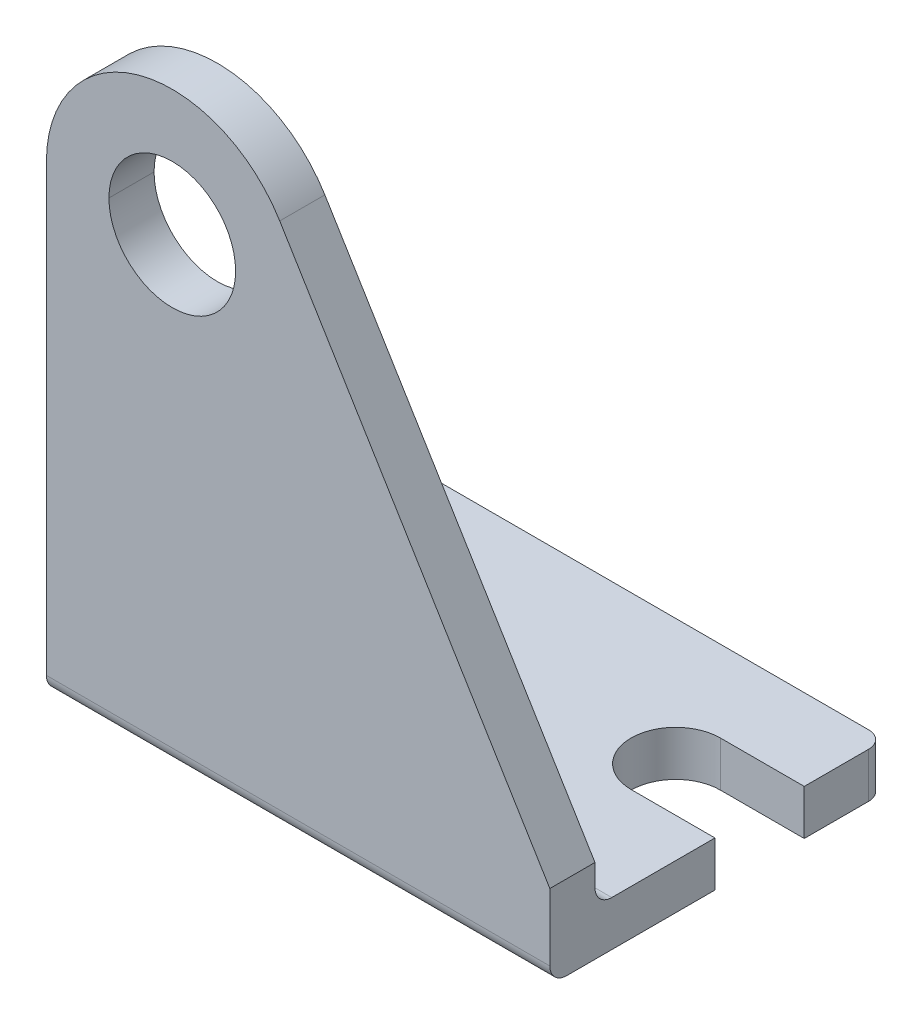
ISO-10303-21;
HEADER;
FILE_DESCRIPTION(('STEP AP214'),'2;1');
FILE_NAME('part.step','',(''),(''),'','','');
FILE_SCHEMA(('AUTOMOTIVE_DESIGN { 1 0 10303 214 1 1 1 1 }'));
ENDSEC;
DATA;
#1=APPLICATION_CONTEXT('core data for automotive mechanical design processes');
#2=APPLICATION_PROTOCOL_DEFINITION('international standard','automotive_design',2000,#1);
#3=PRODUCT_CONTEXT('',#1,'mechanical');
#4=PRODUCT('Part','Part','',(#3));
#5=PRODUCT_RELATED_PRODUCT_CATEGORY('part','',(#4));
#6=PRODUCT_DEFINITION_FORMATION('','',#4);
#7=PRODUCT_DEFINITION_CONTEXT('part definition',#1,'design');
#8=PRODUCT_DEFINITION('design','',#6,#7);
#9=PRODUCT_DEFINITION_SHAPE('','',#8);
#10=(LENGTH_UNIT() NAMED_UNIT(*) SI_UNIT(.MILLI.,.METRE.));
#11=(NAMED_UNIT(*) PLANE_ANGLE_UNIT() SI_UNIT($,.RADIAN.));
#12=(NAMED_UNIT(*) SI_UNIT($,.STERADIAN.) SOLID_ANGLE_UNIT());
#13=UNCERTAINTY_MEASURE_WITH_UNIT(LENGTH_MEASURE(1.E-05),#10,'distance_accuracy_value','');
#14=(GEOMETRIC_REPRESENTATION_CONTEXT(3) GLOBAL_UNCERTAINTY_ASSIGNED_CONTEXT((#13)) GLOBAL_UNIT_ASSIGNED_CONTEXT((#10,
#11,#12)) REPRESENTATION_CONTEXT('',''));
#15=CARTESIAN_POINT('',(0.,0.,0.));
#16=DIRECTION('',(0.,0.,1.));
#17=DIRECTION('',(1.,0.,0.));
#18=AXIS2_PLACEMENT_3D('',#15,#16,#17);
#19=CARTESIAN_POINT('',(6.35,3.4163,-19.2532));
#20=DIRECTION('',(0.,0.,1.));
#21=DIRECTION('',(1.,0.,0.));
#22=AXIS2_PLACEMENT_3D('',#19,#20,#21);
#23=PLANE('',#22);
#24=DIRECTION('',(-1.,0.,0.));
#25=VECTOR('',#24,1.);
#26=CARTESIAN_POINT('',(6.35,0.,-19.2532));
#27=LINE('',#26,#25);
#28=CARTESIAN_POINT('',(6.35,0.,-19.2532));
#29=VERTEX_POINT('',#28);
#30=CARTESIAN_POINT('',(0.,0.,-19.2532));
#31=VERTEX_POINT('',#30);
#32=EDGE_CURVE('E11',#29,#31,#27,.T.);
#33=ORIENTED_EDGE('',*,*,#32,.F.);
#34=DIRECTION('',(0.,-1.,0.));
#35=VECTOR('',#34,1.);
#36=CARTESIAN_POINT('',(6.35,3.4163,-19.2532));
#37=LINE('',#36,#35);
#38=CARTESIAN_POINT('',(6.35,3.4163,-19.2532));
#39=VERTEX_POINT('',#38);
#40=EDGE_CURVE('E25',#39,#29,#37,.T.);
#41=ORIENTED_EDGE('',*,*,#40,.F.);
#42=DIRECTION('',(-1.,0.,0.));
#43=VECTOR('',#42,1.);
#44=CARTESIAN_POINT('',(6.35,3.4163,-19.2532));
#45=LINE('',#44,#43);
#46=CARTESIAN_POINT('',(0.,3.4163,-19.2532));
#47=VERTEX_POINT('',#46);
#48=EDGE_CURVE('E432',#39,#47,#45,.T.);
#49=ORIENTED_EDGE('',*,*,#48,.T.);
#50=DIRECTION('',(0.,-1.,0.));
#51=VECTOR('',#50,1.);
#52=CARTESIAN_POINT('',(0.,3.4163,-19.2532));
#53=LINE('',#52,#51);
#54=EDGE_CURVE('E428',#47,#31,#53,.T.);
#55=ORIENTED_EDGE('',*,*,#54,.T.);
#56=EDGE_LOOP('',(#33,#41,#49,#55));
#57=FACE_BOUND('',#56,.T.);
#58=ADVANCED_FACE('F17',(#57),#23,.T.);
#59=CARTESIAN_POINT('',(0.,1.26999999999997,-1.26999999999999));
#60=DIRECTION('',(1.,0.,0.));
#61=DIRECTION('',(0.,0.,-1.));
#62=AXIS2_PLACEMENT_3D('',#59,#60,#61);
#63=PLANE('',#62);
#64=DIRECTION('',(0.,-1.,0.));
#65=VECTOR('',#64,1.);
#66=CARTESIAN_POINT('',(0.,3.4163,-24.13));
#67=LINE('',#66,#65);
#68=CARTESIAN_POINT('',(0.,3.4163,-24.13));
#69=VERTEX_POINT('',#68);
#70=CARTESIAN_POINT('',(0.,0.,-24.13));
#71=VERTEX_POINT('',#70);
#72=EDGE_CURVE('E424',#69,#71,#67,.T.);
#73=ORIENTED_EDGE('',*,*,#72,.T.);
#74=DIRECTION('',(0.,0.,-1.));
#75=VECTOR('',#74,1.);
#76=CARTESIAN_POINT('',(0.,0.,-1.27));
#77=LINE('',#76,#75);
#78=EDGE_CURVE('E419',#31,#71,#77,.T.);
#79=ORIENTED_EDGE('',*,*,#78,.F.);
#80=ORIENTED_EDGE('',*,*,#54,.F.);
#81=DIRECTION('',(0.,0.,1.));
#82=VECTOR('',#81,1.);
#83=CARTESIAN_POINT('',(0.,3.4163,-25.4));
#84=LINE('',#83,#82);
#85=EDGE_CURVE('E414',#69,#47,#84,.T.);
#86=ORIENTED_EDGE('',*,*,#85,.F.);
#87=EDGE_LOOP('',(#73,#79,#80,#86));
#88=FACE_BOUND('',#87,.T.);
#89=ADVANCED_FACE('F450',(#88),#63,.F.);
#90=CARTESIAN_POINT('',(38.1,3.4163,-25.4));
#91=DIRECTION('',(0.,-1.,0.));
#92=DIRECTION('',(0.,0.,-1.));
#93=AXIS2_PLACEMENT_3D('',#90,#91,#92);
#94=PLANE('',#93);
#95=DIRECTION('',(-1.,0.,0.));
#96=VECTOR('',#95,1.);
#97=CARTESIAN_POINT('',(38.1,3.4163,-25.4));
#98=LINE('',#97,#96);
#99=CARTESIAN_POINT('',(36.83,3.4163,-25.4));
#100=VERTEX_POINT('',#99);
#101=CARTESIAN_POINT('',(1.26999999999986,3.4163,-25.4));
#102=VERTEX_POINT('',#101);
#103=EDGE_CURVE('E410',#100,#102,#98,.T.);
#104=ORIENTED_EDGE('',*,*,#103,.T.);
#105=CARTESIAN_POINT('',(1.26999999999984,3.4163,-24.1300000000001));
#106=DIRECTION('',(0.,1.,0.));
#107=DIRECTION('',(1.,0.,0.));
#108=AXIS2_PLACEMENT_3D('',#105,#106,#107);
#109=CIRCLE('',#108,1.27);
#110=EDGE_CURVE('E405',#102,#69,#109,.T.);
#111=ORIENTED_EDGE('',*,*,#110,.T.);
#112=ORIENTED_EDGE('',*,*,#85,.T.);
#113=ORIENTED_EDGE('',*,*,#48,.F.);
#114=CARTESIAN_POINT('',(6.35,3.4163,-15.875));
#115=DIRECTION('',(0.,1.,0.));
#116=DIRECTION('',(1.,0.,0.));
#117=AXIS2_PLACEMENT_3D('',#114,#115,#116);
#118=CIRCLE('',#117,3.3782);
#119=CARTESIAN_POINT('',(6.35,3.4163,-12.4968));
#120=VERTEX_POINT('',#119);
#121=EDGE_CURVE('E400',#120,#39,#118,.T.);
#122=ORIENTED_EDGE('',*,*,#121,.F.);
#123=DIRECTION('',(1.,0.,0.));
#124=VECTOR('',#123,1.);
#125=CARTESIAN_POINT('',(0.,3.4163,-12.4968));
#126=LINE('',#125,#124);
#127=CARTESIAN_POINT('',(0.,3.4163,-12.4968));
#128=VERTEX_POINT('',#127);
#129=EDGE_CURVE('E395',#128,#120,#126,.T.);
#130=ORIENTED_EDGE('',*,*,#129,.F.);
#131=DIRECTION('',(0.,0.,1.));
#132=VECTOR('',#131,1.);
#133=CARTESIAN_POINT('',(0.,3.4163,-25.4));
#134=LINE('',#133,#132);
#135=CARTESIAN_POINT('',(0.,3.4163,-4.6863));
#136=VERTEX_POINT('',#135);
#137=EDGE_CURVE('E391',#128,#136,#134,.T.);
#138=ORIENTED_EDGE('',*,*,#137,.T.);
#139=DIRECTION('',(-1.,0.,0.));
#140=VECTOR('',#139,1.);
#141=CARTESIAN_POINT('',(38.1,3.4163,-4.6863));
#142=LINE('',#141,#140);
#143=CARTESIAN_POINT('',(38.1,3.4163,-4.6863));
#144=VERTEX_POINT('',#143);
#145=EDGE_CURVE('E386',#144,#136,#142,.T.);
#146=ORIENTED_EDGE('',*,*,#145,.F.);
#147=DIRECTION('',(0.,0.,1.));
#148=VECTOR('',#147,1.);
#149=CARTESIAN_POINT('',(38.1,3.4163,-25.4));
#150=LINE('',#149,#148);
#151=CARTESIAN_POINT('',(38.1,3.4163,-12.4968));
#152=VERTEX_POINT('',#151);
#153=EDGE_CURVE('E381',#152,#144,#150,.T.);
#154=ORIENTED_EDGE('',*,*,#153,.F.);
#155=DIRECTION('',(1.,0.,0.));
#156=VECTOR('',#155,1.);
#157=CARTESIAN_POINT('',(31.75,3.4163,-12.4968));
#158=LINE('',#157,#156);
#159=CARTESIAN_POINT('',(31.75,3.4163,-12.4968));
#160=VERTEX_POINT('',#159);
#161=EDGE_CURVE('E376',#160,#152,#158,.T.);
#162=ORIENTED_EDGE('',*,*,#161,.F.);
#163=CARTESIAN_POINT('',(31.75,3.4163,-15.875));
#164=DIRECTION('',(0.,1.,0.));
#165=DIRECTION('',(1.,0.,0.));
#166=AXIS2_PLACEMENT_3D('',#163,#164,#165);
#167=CIRCLE('',#166,3.3782);
#168=CARTESIAN_POINT('',(31.75,3.4163,-19.2532));
#169=VERTEX_POINT('',#168);
#170=EDGE_CURVE('E371',#169,#160,#167,.T.);
#171=ORIENTED_EDGE('',*,*,#170,.F.);
#172=DIRECTION('',(-1.,0.,0.));
#173=VECTOR('',#172,1.);
#174=CARTESIAN_POINT('',(38.1,3.4163,-19.2532));
#175=LINE('',#174,#173);
#176=CARTESIAN_POINT('',(38.1,3.4163,-19.2532));
#177=VERTEX_POINT('',#176);
#178=EDGE_CURVE('E366',#177,#169,#175,.T.);
#179=ORIENTED_EDGE('',*,*,#178,.F.);
#180=DIRECTION('',(0.,0.,1.));
#181=VECTOR('',#180,1.);
#182=CARTESIAN_POINT('',(38.1,3.4163,-25.4));
#183=LINE('',#182,#181);
#184=CARTESIAN_POINT('',(38.1,3.4163,-24.13));
#185=VERTEX_POINT('',#184);
#186=EDGE_CURVE('E361',#185,#177,#183,.T.);
#187=ORIENTED_EDGE('',*,*,#186,.F.);
#188=CARTESIAN_POINT('',(36.8300000000003,3.4163,-24.1300000000003));
#189=DIRECTION('',(0.,1.,0.));
#190=DIRECTION('',(1.,0.,0.));
#191=AXIS2_PLACEMENT_3D('',#188,#189,#190);
#192=CIRCLE('',#191,1.27);
#193=EDGE_CURVE('E357',#185,#100,#192,.T.);
#194=ORIENTED_EDGE('',*,*,#193,.T.);
#195=EDGE_LOOP('',(#104,#111,#112,#113,#122,#130,#138,#146,#154,#162,#171,#179,#187,#194));
#196=FACE_BOUND('',#195,.T.);
#197=ADVANCED_FACE('F445',(#196),#94,.F.);
#198=CARTESIAN_POINT('',(36.8300000000003,3.4163,-24.1300000000003));
#199=DIRECTION('',(0.,1.,0.));
#200=DIRECTION('',(-0.707106781186554,0.,0.707106781186541));
#201=AXIS2_PLACEMENT_3D('',#198,#199,#200);
#202=CYLINDRICAL_SURFACE('',#201,1.27);
#203=CARTESIAN_POINT('',(36.8300000000003,0.,-24.1300000000003));
#204=DIRECTION('',(0.,1.,0.));
#205=DIRECTION('',(1.,0.,0.));
#206=AXIS2_PLACEMENT_3D('',#203,#204,#205);
#207=CIRCLE('',#206,1.27);
#208=CARTESIAN_POINT('',(38.1,0.,-24.13));
#209=VERTEX_POINT('',#208);
#210=CARTESIAN_POINT('',(36.8300000000003,0.,-25.4));
#211=VERTEX_POINT('',#210);
#212=EDGE_CURVE('E353',#209,#211,#207,.T.);
#213=ORIENTED_EDGE('',*,*,#212,.T.);
#214=DIRECTION('',(0.,-1.,0.));
#215=VECTOR('',#214,1.);
#216=CARTESIAN_POINT('',(36.83,3.4163,-25.4));
#217=LINE('',#216,#215);
#218=EDGE_CURVE('E348',#100,#211,#217,.T.);
#219=ORIENTED_EDGE('',*,*,#218,.F.);
#220=ORIENTED_EDGE('',*,*,#193,.F.);
#221=DIRECTION('',(0.,-1.,0.));
#222=VECTOR('',#221,1.);
#223=CARTESIAN_POINT('',(38.1,3.4163,-24.13));
#224=LINE('',#223,#222);
#225=EDGE_CURVE('E344',#185,#209,#224,.T.);
#226=ORIENTED_EDGE('',*,*,#225,.T.);
#227=EDGE_LOOP('',(#213,#219,#220,#226));
#228=FACE_BOUND('',#227,.T.);
#229=ADVANCED_FACE('F488',(#228),#202,.T.);
#230=CARTESIAN_POINT('',(38.1,1.26999999999997,-1.26999999999999));
#231=DIRECTION('',(1.,0.,0.));
#232=DIRECTION('',(0.,0.,-1.));
#233=AXIS2_PLACEMENT_3D('',#230,#231,#232);
#234=PLANE('',#233);
#235=DIRECTION('',(0.,0.,-1.));
#236=VECTOR('',#235,1.);
#237=CARTESIAN_POINT('',(38.1,0.,-1.27));
#238=LINE('',#237,#236);
#239=CARTESIAN_POINT('',(38.1,0.,-19.2532));
#240=VERTEX_POINT('',#239);
#241=EDGE_CURVE('E339',#240,#209,#238,.T.);
#242=ORIENTED_EDGE('',*,*,#241,.T.);
#243=ORIENTED_EDGE('',*,*,#225,.F.);
#244=ORIENTED_EDGE('',*,*,#186,.T.);
#245=DIRECTION('',(0.,-1.,0.));
#246=VECTOR('',#245,1.);
#247=CARTESIAN_POINT('',(38.1,3.4163,-19.2532));
#248=LINE('',#247,#246);
#249=EDGE_CURVE('E335',#177,#240,#248,.T.);
#250=ORIENTED_EDGE('',*,*,#249,.T.);
#251=EDGE_LOOP('',(#242,#243,#244,#250));
#252=FACE_BOUND('',#251,.T.);
#253=ADVANCED_FACE('F485',(#252),#234,.T.);
#254=CARTESIAN_POINT('',(38.1,3.4163,-19.2532));
#255=DIRECTION('',(0.,0.,1.));
#256=DIRECTION('',(1.,0.,0.));
#257=AXIS2_PLACEMENT_3D('',#254,#255,#256);
#258=PLANE('',#257);
#259=DIRECTION('',(-1.,0.,0.));
#260=VECTOR('',#259,1.);
#261=CARTESIAN_POINT('',(38.1,0.,-19.2532));
#262=LINE('',#261,#260);
#263=CARTESIAN_POINT('',(31.75,0.,-19.2532));
#264=VERTEX_POINT('',#263);
#265=EDGE_CURVE('E330',#240,#264,#262,.T.);
#266=ORIENTED_EDGE('',*,*,#265,.F.);
#267=ORIENTED_EDGE('',*,*,#249,.F.);
#268=ORIENTED_EDGE('',*,*,#178,.T.);
#269=DIRECTION('',(0.,-1.,0.));
#270=VECTOR('',#269,1.);
#271=CARTESIAN_POINT('',(31.75,3.4163,-19.2532));
#272=LINE('',#271,#270);
#273=EDGE_CURVE('E326',#169,#264,#272,.T.);
#274=ORIENTED_EDGE('',*,*,#273,.T.);
#275=EDGE_LOOP('',(#266,#267,#268,#274));
#276=FACE_BOUND('',#275,.T.);
#277=ADVANCED_FACE('F479',(#276),#258,.T.);
#278=CARTESIAN_POINT('',(31.75,3.4163,-15.875));
#279=DIRECTION('',(0.,1.,0.));
#280=DIRECTION('',(1.,0.,0.));
#281=AXIS2_PLACEMENT_3D('',#278,#279,#280);
#282=CYLINDRICAL_SURFACE('',#281,3.3782);
#283=ORIENTED_EDGE('',*,*,#273,.F.);
#284=ORIENTED_EDGE('',*,*,#170,.T.);
#285=DIRECTION('',(0.,-1.,0.));
#286=VECTOR('',#285,1.);
#287=CARTESIAN_POINT('',(31.75,3.4163,-12.4968));
#288=LINE('',#287,#286);
#289=CARTESIAN_POINT('',(31.75,0.,-12.4968));
#290=VERTEX_POINT('',#289);
#291=EDGE_CURVE('E322',#160,#290,#288,.T.);
#292=ORIENTED_EDGE('',*,*,#291,.T.);
#293=CARTESIAN_POINT('',(31.75,0.,-15.875));
#294=DIRECTION('',(0.,1.,0.));
#295=DIRECTION('',(1.,0.,0.));
#296=AXIS2_PLACEMENT_3D('',#293,#294,#295);
#297=CIRCLE('',#296,3.3782);
#298=EDGE_CURVE('E317',#264,#290,#297,.T.);
#299=ORIENTED_EDGE('',*,*,#298,.F.);
#300=EDGE_LOOP('',(#283,#284,#292,#299));
#301=FACE_BOUND('',#300,.T.);
#302=ADVANCED_FACE('F475',(#301),#282,.F.);
#303=CARTESIAN_POINT('',(38.1,0.,-1.27));
#304=DIRECTION('',(0.,1.,0.));
#305=DIRECTION('',(0.,0.,1.));
#306=AXIS2_PLACEMENT_3D('',#303,#304,#305);
#307=PLANE('',#306);
#308=ORIENTED_EDGE('',*,*,#78,.T.);
#309=CARTESIAN_POINT('',(1.26999999999984,0.,-24.1300000000001));
#310=DIRECTION('',(0.,1.,0.));
#311=DIRECTION('',(1.,0.,0.));
#312=AXIS2_PLACEMENT_3D('',#309,#310,#311);
#313=CIRCLE('',#312,1.27);
#314=CARTESIAN_POINT('',(1.2699999999999,0.,-25.4));
#315=VERTEX_POINT('',#314);
#316=EDGE_CURVE('E312',#315,#71,#313,.T.);
#317=ORIENTED_EDGE('',*,*,#316,.F.);
#318=DIRECTION('',(-1.,0.,0.));
#319=VECTOR('',#318,1.);
#320=CARTESIAN_POINT('',(38.1,0.,-25.4));
#321=LINE('',#320,#319);
#322=EDGE_CURVE('E307',#211,#315,#321,.T.);
#323=ORIENTED_EDGE('',*,*,#322,.F.);
#324=ORIENTED_EDGE('',*,*,#212,.F.);
#325=ORIENTED_EDGE('',*,*,#241,.F.);
#326=ORIENTED_EDGE('',*,*,#265,.T.);
#327=ORIENTED_EDGE('',*,*,#298,.T.);
#328=DIRECTION('',(1.,0.,0.));
#329=VECTOR('',#328,1.);
#330=CARTESIAN_POINT('',(31.75,0.,-12.4968));
#331=LINE('',#330,#329);
#332=CARTESIAN_POINT('',(38.1,0.,-12.4968));
#333=VERTEX_POINT('',#332);
#334=EDGE_CURVE('E303',#290,#333,#331,.T.);
#335=ORIENTED_EDGE('',*,*,#334,.T.);
#336=DIRECTION('',(0.,0.,-1.));
#337=VECTOR('',#336,1.);
#338=CARTESIAN_POINT('',(38.1,0.,-1.27));
#339=LINE('',#338,#337);
#340=CARTESIAN_POINT('',(38.1,0.,-1.27));
#341=VERTEX_POINT('',#340);
#342=EDGE_CURVE('E298',#341,#333,#339,.T.);
#343=ORIENTED_EDGE('',*,*,#342,.F.);
#344=DIRECTION('',(-1.,0.,0.));
#345=VECTOR('',#344,1.);
#346=CARTESIAN_POINT('',(38.1,0.,-1.27));
#347=LINE('',#346,#345);
#348=CARTESIAN_POINT('',(0.,0.,-1.27));
#349=VERTEX_POINT('',#348);
#350=EDGE_CURVE('E294',#341,#349,#347,.T.);
#351=ORIENTED_EDGE('',*,*,#350,.T.);
#352=DIRECTION('',(0.,0.,-1.));
#353=VECTOR('',#352,1.);
#354=CARTESIAN_POINT('',(0.,0.,-1.27));
#355=LINE('',#354,#353);
#356=CARTESIAN_POINT('',(0.,0.,-12.4968));
#357=VERTEX_POINT('',#356);
#358=EDGE_CURVE('E290',#349,#357,#355,.T.);
#359=ORIENTED_EDGE('',*,*,#358,.T.);
#360=DIRECTION('',(1.,0.,0.));
#361=VECTOR('',#360,1.);
#362=CARTESIAN_POINT('',(0.,0.,-12.4968));
#363=LINE('',#362,#361);
#364=CARTESIAN_POINT('',(6.35,0.,-12.4968));
#365=VERTEX_POINT('',#364);
#366=EDGE_CURVE('E286',#357,#365,#363,.T.);
#367=ORIENTED_EDGE('',*,*,#366,.T.);
#368=CARTESIAN_POINT('',(6.35,0.,-15.875));
#369=DIRECTION('',(0.,1.,0.));
#370=DIRECTION('',(1.,0.,0.));
#371=AXIS2_PLACEMENT_3D('',#368,#369,#370);
#372=CIRCLE('',#371,3.3782);
#373=EDGE_CURVE('E282',#365,#29,#372,.T.);
#374=ORIENTED_EDGE('',*,*,#373,.T.);
#375=ORIENTED_EDGE('',*,*,#32,.T.);
#376=EDGE_LOOP('',(#308,#317,#323,#324,#325,#326,#327,#335,#343,#351,#359,#367,#374,#375));
#377=FACE_BOUND('',#376,.T.);
#378=ADVANCED_FACE('F453',(#377),#307,.F.);
#379=CARTESIAN_POINT('',(6.35,3.4163,-15.875));
#380=DIRECTION('',(0.,1.,0.));
#381=DIRECTION('',(-1.,0.,0.));
#382=AXIS2_PLACEMENT_3D('',#379,#380,#381);
#383=CYLINDRICAL_SURFACE('',#382,3.3782);
#384=ORIENTED_EDGE('',*,*,#40,.T.);
#385=ORIENTED_EDGE('',*,*,#373,.F.);
#386=DIRECTION('',(0.,-1.,0.));
#387=VECTOR('',#386,1.);
#388=CARTESIAN_POINT('',(6.35,3.4163,-12.4968));
#389=LINE('',#388,#387);
#390=EDGE_CURVE('E277',#120,#365,#389,.T.);
#391=ORIENTED_EDGE('',*,*,#390,.F.);
#392=ORIENTED_EDGE('',*,*,#121,.T.);
#393=EDGE_LOOP('',(#384,#385,#391,#392));
#394=FACE_BOUND('',#393,.T.);
#395=ADVANCED_FACE('F442',(#394),#383,.F.);
#396=CARTESIAN_POINT('',(0.,3.4163,-12.4968));
#397=DIRECTION('',(0.,0.,-1.));
#398=DIRECTION('',(-1.,0.,0.));
#399=AXIS2_PLACEMENT_3D('',#396,#397,#398);
#400=PLANE('',#399);
#401=ORIENTED_EDGE('',*,*,#366,.F.);
#402=DIRECTION('',(0.,-1.,0.));
#403=VECTOR('',#402,1.);
#404=CARTESIAN_POINT('',(0.,3.4163,-12.4968));
#405=LINE('',#404,#403);
#406=EDGE_CURVE('E272',#128,#357,#405,.T.);
#407=ORIENTED_EDGE('',*,*,#406,.F.);
#408=ORIENTED_EDGE('',*,*,#129,.T.);
#409=ORIENTED_EDGE('',*,*,#390,.T.);
#410=EDGE_LOOP('',(#401,#407,#408,#409));
#411=FACE_BOUND('',#410,.T.);
#412=ADVANCED_FACE('F457',(#411),#400,.T.);
#413=CARTESIAN_POINT('',(0.,1.26999999999997,-1.26999999999999));
#414=DIRECTION('',(1.,0.,0.));
#415=DIRECTION('',(0.,0.,-1.));
#416=AXIS2_PLACEMENT_3D('',#413,#414,#415);
#417=PLANE('',#416);
#418=ORIENTED_EDGE('',*,*,#406,.T.);
#419=ORIENTED_EDGE('',*,*,#358,.F.);
#420=CARTESIAN_POINT('',(0.,1.26999999999997,-1.26999999999999));
#421=DIRECTION('',(1.,0.,0.));
#422=DIRECTION('',(0.,0.,-1.));
#423=AXIS2_PLACEMENT_3D('',#420,#421,#422);
#424=CIRCLE('',#423,1.27);
#425=CARTESIAN_POINT('',(0.,1.27,0.));
#426=VERTEX_POINT('',#425);
#427=EDGE_CURVE('E267',#426,#349,#424,.T.);
#428=ORIENTED_EDGE('',*,*,#427,.F.);
#429=DIRECTION('',(0.,-1.,0.));
#430=VECTOR('',#429,1.);
#431=CARTESIAN_POINT('',(0.,44.45,0.));
#432=LINE('',#431,#430);
#433=CARTESIAN_POINT('',(0.,34.925,0.));
#434=VERTEX_POINT('',#433);
#435=EDGE_CURVE('E262',#434,#426,#432,.T.);
#436=ORIENTED_EDGE('',*,*,#435,.F.);
#437=DIRECTION('',(0.,0.,1.));
#438=VECTOR('',#437,1.);
#439=CARTESIAN_POINT('',(0.,34.9250000000003,-25.4));
#440=LINE('',#439,#438);
#441=CARTESIAN_POINT('',(0.,34.9250000000003,-3.4163));
#442=VERTEX_POINT('',#441);
#443=EDGE_CURVE('E257',#442,#434,#440,.T.);
#444=ORIENTED_EDGE('',*,*,#443,.F.);
#445=DIRECTION('',(0.,1.,0.));
#446=VECTOR('',#445,1.);
#447=CARTESIAN_POINT('',(0.,4.6863,-3.4163));
#448=LINE('',#447,#446);
#449=CARTESIAN_POINT('',(0.,4.6863,-3.4163));
#450=VERTEX_POINT('',#449);
#451=EDGE_CURVE('E252',#450,#442,#448,.T.);
#452=ORIENTED_EDGE('',*,*,#451,.F.);
#453=CARTESIAN_POINT('',(0.,4.68630000000005,-4.68630000000005));
#454=DIRECTION('',(1.,0.,0.));
#455=DIRECTION('',(0.,0.,-1.));
#456=AXIS2_PLACEMENT_3D('',#453,#454,#455);
#457=CIRCLE('',#456,1.27);
#458=EDGE_CURVE('E247',#450,#136,#457,.T.);
#459=ORIENTED_EDGE('',*,*,#458,.T.);
#460=ORIENTED_EDGE('',*,*,#137,.F.);
#461=EDGE_LOOP('',(#418,#419,#428,#436,#444,#452,#459,#460));
#462=FACE_BOUND('',#461,.T.);
#463=ADVANCED_FACE('F460',(#462),#417,.F.);
#464=CARTESIAN_POINT('',(38.1,4.68630000000005,-4.68630000000005));
#465=DIRECTION('',(1.,0.,0.));
#466=DIRECTION('',(0.,0.707106781186533,-0.707106781186562));
#467=AXIS2_PLACEMENT_3D('',#464,#465,#466);
#468=CYLINDRICAL_SURFACE('',#467,1.27);
#469=ORIENTED_EDGE('',*,*,#145,.T.);
#470=ORIENTED_EDGE('',*,*,#458,.F.);
#471=DIRECTION('',(-1.,0.,0.));
#472=VECTOR('',#471,1.);
#473=CARTESIAN_POINT('',(38.1,4.6863,-3.4163));
#474=LINE('',#473,#472);
#475=CARTESIAN_POINT('',(38.1,4.6863,-3.4163));
#476=VERTEX_POINT('',#475);
#477=EDGE_CURVE('E242',#476,#450,#474,.T.);
#478=ORIENTED_EDGE('',*,*,#477,.F.);
#479=CARTESIAN_POINT('',(38.1,4.68630000000005,-4.68630000000005));
#480=DIRECTION('',(1.,0.,0.));
#481=DIRECTION('',(0.,0.,-1.));
#482=AXIS2_PLACEMENT_3D('',#479,#480,#481);
#483=CIRCLE('',#482,1.27);
#484=EDGE_CURVE('E237',#476,#144,#483,.T.);
#485=ORIENTED_EDGE('',*,*,#484,.T.);
#486=EDGE_LOOP('',(#469,#470,#478,#485));
#487=FACE_BOUND('',#486,.T.);
#488=ADVANCED_FACE('F465',(#487),#468,.F.);
#489=CARTESIAN_POINT('',(38.1,1.26999999999997,-1.26999999999999));
#490=DIRECTION('',(1.,0.,0.));
#491=DIRECTION('',(0.,0.,-1.));
#492=AXIS2_PLACEMENT_3D('',#489,#490,#491);
#493=PLANE('',#492);
#494=ORIENTED_EDGE('',*,*,#342,.T.);
#495=DIRECTION('',(0.,-1.,0.));
#496=VECTOR('',#495,1.);
#497=CARTESIAN_POINT('',(38.1,3.4163,-12.4968));
#498=LINE('',#497,#496);
#499=EDGE_CURVE('E232',#152,#333,#498,.T.);
#500=ORIENTED_EDGE('',*,*,#499,.F.);
#501=ORIENTED_EDGE('',*,*,#153,.T.);
#502=ORIENTED_EDGE('',*,*,#484,.F.);
#503=DIRECTION('',(0.,1.,0.));
#504=VECTOR('',#503,1.);
#505=CARTESIAN_POINT('',(38.1,4.6863,-3.4163));
#506=LINE('',#505,#504);
#507=CARTESIAN_POINT('',(38.1,6.35,-3.4163));
#508=VERTEX_POINT('',#507);
#509=EDGE_CURVE('E228',#476,#508,#506,.T.);
#510=ORIENTED_EDGE('',*,*,#509,.T.);
#511=DIRECTION('',(0.,0.,1.));
#512=VECTOR('',#511,1.);
#513=CARTESIAN_POINT('',(38.1,6.35,-1.26999999999999));
#514=LINE('',#513,#512);
#515=CARTESIAN_POINT('',(38.1,6.35,0.));
#516=VERTEX_POINT('',#515);
#517=EDGE_CURVE('E224',#508,#516,#514,.T.);
#518=ORIENTED_EDGE('',*,*,#517,.T.);
#519=DIRECTION('',(0.,-1.,0.));
#520=VECTOR('',#519,1.);
#521=CARTESIAN_POINT('',(38.1,44.45,0.));
#522=LINE('',#521,#520);
#523=CARTESIAN_POINT('',(38.1,1.27,0.));
#524=VERTEX_POINT('',#523);
#525=EDGE_CURVE('E220',#516,#524,#522,.T.);
#526=ORIENTED_EDGE('',*,*,#525,.T.);
#527=CARTESIAN_POINT('',(38.1,1.26999999999997,-1.26999999999999));
#528=DIRECTION('',(1.,0.,0.));
#529=DIRECTION('',(0.,0.,-1.));
#530=AXIS2_PLACEMENT_3D('',#527,#528,#529);
#531=CIRCLE('',#530,1.27);
#532=EDGE_CURVE('E215',#524,#341,#531,.T.);
#533=ORIENTED_EDGE('',*,*,#532,.T.);
#534=EDGE_LOOP('',(#494,#500,#501,#502,#510,#518,#526,#533));
#535=FACE_BOUND('',#534,.T.);
#536=ADVANCED_FACE('F468',(#535),#493,.T.);
#537=CARTESIAN_POINT('',(38.1,1.26999999999997,-1.26999999999999));
#538=DIRECTION('',(1.,0.,0.));
#539=DIRECTION('',(0.,0.707106781186558,-0.707106781186537));
#540=AXIS2_PLACEMENT_3D('',#537,#538,#539);
#541=CYLINDRICAL_SURFACE('',#540,1.27);
#542=ORIENTED_EDGE('',*,*,#427,.T.);
#543=ORIENTED_EDGE('',*,*,#350,.F.);
#544=ORIENTED_EDGE('',*,*,#532,.F.);
#545=DIRECTION('',(-1.,0.,0.));
#546=VECTOR('',#545,1.);
#547=CARTESIAN_POINT('',(38.1,1.27,0.));
#548=LINE('',#547,#546);
#549=EDGE_CURVE('E210',#524,#426,#548,.T.);
#550=ORIENTED_EDGE('',*,*,#549,.T.);
#551=EDGE_LOOP('',(#542,#543,#544,#550));
#552=FACE_BOUND('',#551,.T.);
#553=ADVANCED_FACE('F505',(#552),#541,.T.);
#554=CARTESIAN_POINT('',(38.1,44.45,0.));
#555=DIRECTION('',(0.,0.,-1.));
#556=DIRECTION('',(-1.,0.,0.));
#557=AXIS2_PLACEMENT_3D('',#554,#555,#556);
#558=PLANE('',#557);
#559=CARTESIAN_POINT('',(9.525,34.925,0.));
#560=DIRECTION('',(0.,0.,1.));
#561=DIRECTION('',(1.,0.,0.));
#562=AXIS2_PLACEMENT_3D('',#559,#560,#561);
#563=CIRCLE('',#562,4.79425);
#564=CARTESIAN_POINT('',(14.31925,34.925,0.));
#565=VERTEX_POINT('',#564);
#566=CARTESIAN_POINT('',(4.73075,34.925,0.));
#567=VERTEX_POINT('',#566);
#568=EDGE_CURVE('E206',#565,#567,#563,.T.);
#569=ORIENTED_EDGE('',*,*,#568,.F.);
#570=CARTESIAN_POINT('',(9.525,34.925,0.));
#571=DIRECTION('',(0.,0.,1.));
#572=DIRECTION('',(1.,0.,0.));
#573=AXIS2_PLACEMENT_3D('',#570,#571,#572);
#574=CIRCLE('',#573,4.79425);
#575=EDGE_CURVE('E170',#567,#565,#574,.T.);
#576=ORIENTED_EDGE('',*,*,#575,.F.);
#577=EDGE_LOOP('',(#569,#576));
#578=FACE_BOUND('',#577,.T.);
#579=CARTESIAN_POINT('',(9.52499999999992,34.9250000000003,0.));
#580=DIRECTION('',(0.,0.,1.));
#581=DIRECTION('',(1.,0.,0.));
#582=AXIS2_PLACEMENT_3D('',#579,#580,#581);
#583=CIRCLE('',#582,9.525);
#584=CARTESIAN_POINT('',(17.657930180668,39.8829301806679,0.));
#585=VERTEX_POINT('',#584);
#586=EDGE_CURVE('E198',#585,#434,#583,.T.);
#587=ORIENTED_EDGE('',*,*,#586,.T.);
#588=ORIENTED_EDGE('',*,*,#435,.T.);
#589=ORIENTED_EDGE('',*,*,#549,.F.);
#590=ORIENTED_EDGE('',*,*,#525,.F.);
#591=DIRECTION('',(-0.520517604269611,0.853850937602943,0.));
#592=VECTOR('',#591,1.);
#593=CARTESIAN_POINT('',(38.1,6.35,0.));
#594=LINE('',#593,#592);
#595=EDGE_CURVE('E194',#516,#585,#594,.T.);
#596=ORIENTED_EDGE('',*,*,#595,.T.);
#597=EDGE_LOOP('',(#587,#588,#589,#590,#596));
#598=FACE_BOUND('',#597,.T.);
#599=ADVANCED_FACE('F508',(#578,#598),#558,.F.);
#600=CARTESIAN_POINT('',(38.1,6.35,-25.4));
#601=DIRECTION('',(0.853850937602943,0.520517604269611,0.));
#602=DIRECTION('',(-0.520517604269611,0.853850937602943,0.));
#603=AXIS2_PLACEMENT_3D('',#600,#601,#602);
#604=PLANE('',#603);
#605=DIRECTION('',(-0.520517604269611,0.853850937602943,0.));
#606=VECTOR('',#605,1.);
#607=CARTESIAN_POINT('',(38.8394222222222,5.13706050948112,-3.4163));
#608=LINE('',#607,#606);
#609=CARTESIAN_POINT('',(17.657930180668,39.8829301806679,-3.4163));
#610=VERTEX_POINT('',#609);
#611=EDGE_CURVE('E190',#508,#610,#608,.T.);
#612=ORIENTED_EDGE('',*,*,#611,.T.);
#613=DIRECTION('',(0.,0.,1.));
#614=VECTOR('',#613,1.);
#615=CARTESIAN_POINT('',(17.657930180668,39.8829301806679,-25.4));
#616=LINE('',#615,#614);
#617=EDGE_CURVE('E179',#610,#585,#616,.T.);
#618=ORIENTED_EDGE('',*,*,#617,.T.);
#619=ORIENTED_EDGE('',*,*,#595,.F.);
#620=ORIENTED_EDGE('',*,*,#517,.F.);
#621=EDGE_LOOP('',(#612,#618,#619,#620));
#622=FACE_BOUND('',#621,.T.);
#623=ADVANCED_FACE('F517',(#622),#604,.T.);
#624=CARTESIAN_POINT('',(9.52499999999992,34.9250000000003,-25.4));
#625=DIRECTION('',(0.,0.,-1.));
#626=DIRECTION('',(0.270323012706145,-0.96276968627054,0.));
#627=AXIS2_PLACEMENT_3D('',#624,#625,#626);
#628=CYLINDRICAL_SURFACE('',#627,9.525);
#629=CARTESIAN_POINT('',(9.52499999999992,34.9250000000003,-3.4163));
#630=DIRECTION('',(0.,0.,1.));
#631=DIRECTION('',(1.,0.,0.));
#632=AXIS2_PLACEMENT_3D('',#629,#630,#631);
#633=CIRCLE('',#632,9.525);
#634=EDGE_CURVE('E176',#610,#442,#633,.T.);
#635=ORIENTED_EDGE('',*,*,#634,.T.);
#636=ORIENTED_EDGE('',*,*,#443,.T.);
#637=ORIENTED_EDGE('',*,*,#586,.F.);
#638=ORIENTED_EDGE('',*,*,#617,.F.);
#639=EDGE_LOOP('',(#635,#636,#637,#638));
#640=FACE_BOUND('',#639,.T.);
#641=ADVANCED_FACE('F512',(#640),#628,.T.);
#642=CARTESIAN_POINT('',(38.1,4.6863,-3.4163));
#643=DIRECTION('',(0.,0.,1.));
#644=DIRECTION('',(1.,0.,0.));
#645=AXIS2_PLACEMENT_3D('',#642,#643,#644);
#646=PLANE('',#645);
#647=CARTESIAN_POINT('',(9.525,34.925,-3.4163));
#648=DIRECTION('',(0.,0.,1.));
#649=DIRECTION('',(1.,0.,0.));
#650=AXIS2_PLACEMENT_3D('',#647,#648,#649);
#651=CIRCLE('',#650,4.79425);
#652=CARTESIAN_POINT('',(14.31925,34.925,-3.4163));
#653=VERTEX_POINT('',#652);
#654=CARTESIAN_POINT('',(4.73075,34.925,-3.4163));
#655=VERTEX_POINT('',#654);
#656=EDGE_CURVE('E160',#653,#655,#651,.T.);
#657=ORIENTED_EDGE('',*,*,#656,.T.);
#658=CARTESIAN_POINT('',(9.525,34.925,-3.4163));
#659=DIRECTION('',(0.,0.,1.));
#660=DIRECTION('',(1.,0.,0.));
#661=AXIS2_PLACEMENT_3D('',#658,#659,#660);
#662=CIRCLE('',#661,4.79425);
#663=EDGE_CURVE('E155',#655,#653,#662,.T.);
#664=ORIENTED_EDGE('',*,*,#663,.T.);
#665=EDGE_LOOP('',(#657,#664));
#666=FACE_BOUND('',#665,.T.);
#667=ORIENTED_EDGE('',*,*,#451,.T.);
#668=ORIENTED_EDGE('',*,*,#634,.F.);
#669=ORIENTED_EDGE('',*,*,#611,.F.);
#670=ORIENTED_EDGE('',*,*,#509,.F.);
#671=ORIENTED_EDGE('',*,*,#477,.T.);
#672=EDGE_LOOP('',(#667,#668,#669,#670,#671));
#673=FACE_BOUND('',#672,.T.);
#674=ADVANCED_FACE('F157',(#666,#673),#646,.F.);
#675=CARTESIAN_POINT('',(9.525,34.925,-3.4163));
#676=DIRECTION('',(0.,0.,-1.));
#677=DIRECTION('',(0.,1.,0.));
#678=AXIS2_PLACEMENT_3D('',#675,#676,#677);
#679=CYLINDRICAL_SURFACE('',#678,4.79425);
#680=ORIENTED_EDGE('',*,*,#663,.F.);
#681=DIRECTION('',(0.,0.,-1.));
#682=VECTOR('',#681,1.);
#683=CARTESIAN_POINT('',(4.73075,34.925,0.));
#684=LINE('',#683,#682);
#685=EDGE_CURVE('E164',#567,#655,#684,.T.);
#686=ORIENTED_EDGE('',*,*,#685,.F.);
#687=ORIENTED_EDGE('',*,*,#575,.T.);
#688=DIRECTION('',(0.,0.,-1.));
#689=VECTOR('',#688,1.);
#690=CARTESIAN_POINT('',(14.31925,34.925,0.));
#691=LINE('',#690,#689);
#692=EDGE_CURVE('E168',#565,#653,#691,.T.);
#693=ORIENTED_EDGE('',*,*,#692,.T.);
#694=EDGE_LOOP('',(#680,#686,#687,#693));
#695=FACE_BOUND('',#694,.T.);
#696=ADVANCED_FACE('F169',(#695),#679,.F.);
#697=CARTESIAN_POINT('',(9.525,34.925,-3.4163));
#698=DIRECTION('',(0.,0.,-1.));
#699=DIRECTION('',(0.,-1.,0.));
#700=AXIS2_PLACEMENT_3D('',#697,#698,#699);
#701=CYLINDRICAL_SURFACE('',#700,4.79425);
#702=ORIENTED_EDGE('',*,*,#568,.T.);
#703=ORIENTED_EDGE('',*,*,#685,.T.);
#704=ORIENTED_EDGE('',*,*,#656,.F.);
#705=ORIENTED_EDGE('',*,*,#692,.F.);
#706=EDGE_LOOP('',(#702,#703,#704,#705));
#707=FACE_BOUND('',#706,.T.);
#708=ADVANCED_FACE('F175',(#707),#701,.F.);
#709=CARTESIAN_POINT('',(31.75,3.4163,-12.4968));
#710=DIRECTION('',(0.,0.,-1.));
#711=DIRECTION('',(-1.,0.,0.));
#712=AXIS2_PLACEMENT_3D('',#709,#710,#711);
#713=PLANE('',#712);
#714=ORIENTED_EDGE('',*,*,#334,.F.);
#715=ORIENTED_EDGE('',*,*,#291,.F.);
#716=ORIENTED_EDGE('',*,*,#161,.T.);
#717=ORIENTED_EDGE('',*,*,#499,.T.);
#718=EDGE_LOOP('',(#714,#715,#716,#717));
#719=FACE_BOUND('',#718,.T.);
#720=ADVANCED_FACE('F472',(#719),#713,.T.);
#721=CARTESIAN_POINT('',(38.1,0.,-25.4));
#722=DIRECTION('',(0.,0.,1.));
#723=DIRECTION('',(1.,0.,0.));
#724=AXIS2_PLACEMENT_3D('',#721,#722,#723);
#725=PLANE('',#724);
#726=ORIENTED_EDGE('',*,*,#322,.T.);
#727=DIRECTION('',(0.,-1.,0.));
#728=VECTOR('',#727,1.);
#729=CARTESIAN_POINT('',(1.2699999999999,3.4163,-25.4));
#730=LINE('',#729,#728);
#731=EDGE_CURVE('E173',#102,#315,#730,.T.);
#732=ORIENTED_EDGE('',*,*,#731,.F.);
#733=ORIENTED_EDGE('',*,*,#103,.F.);
#734=ORIENTED_EDGE('',*,*,#218,.T.);
#735=EDGE_LOOP('',(#726,#732,#733,#734));
#736=FACE_BOUND('',#735,.T.);
#737=ADVANCED_FACE('F496',(#736),#725,.F.);
#738=CARTESIAN_POINT('',(1.26999999999984,3.4163,-24.1300000000001));
#739=DIRECTION('',(0.,1.,0.));
#740=DIRECTION('',(0.707106781186605,0.,0.70710678118649));
#741=AXIS2_PLACEMENT_3D('',#738,#739,#740);
#742=CYLINDRICAL_SURFACE('',#741,1.27);
#743=ORIENTED_EDGE('',*,*,#316,.T.);
#744=ORIENTED_EDGE('',*,*,#72,.F.);
#745=ORIENTED_EDGE('',*,*,#110,.F.);
#746=ORIENTED_EDGE('',*,*,#731,.T.);
#747=EDGE_LOOP('',(#743,#744,#745,#746));
#748=FACE_BOUND('',#747,.T.);
#749=ADVANCED_FACE('F499',(#748),#742,.T.);
#750=CLOSED_SHELL('',(#58,#89,#197,#229,#253,#277,#302,#378,#395,#412,#463,#488,#536,#553,#599,
#623,#641,#674,#696,#708,#720,#737,#749));
#751=MANIFOLD_SOLID_BREP('B1',#750);
#752=ADVANCED_BREP_SHAPE_REPRESENTATION('',(#18,#751),#14);
#753=SHAPE_DEFINITION_REPRESENTATION(#9,#752);
ENDSEC;
END-ISO-10303-21;
